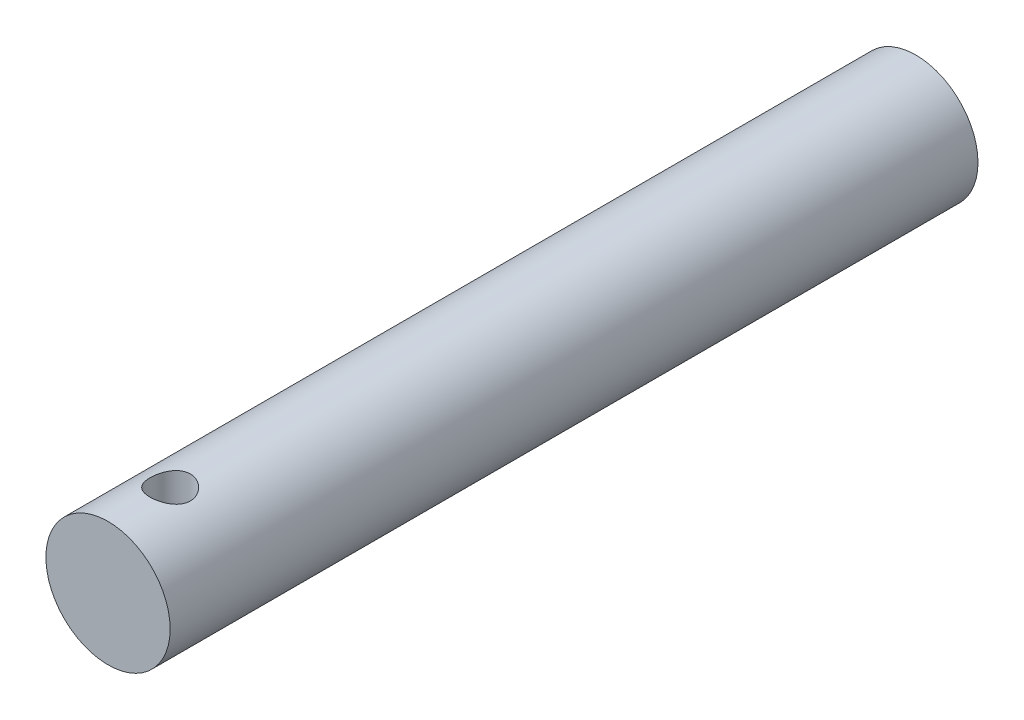
ISO-10303-21;
HEADER;
FILE_DESCRIPTION(('STEP AP214'),'2;1');
FILE_NAME('part.step','',(''),(''),'','','');
FILE_SCHEMA(('AUTOMOTIVE_DESIGN { 1 0 10303 214 1 1 1 1 }'));
ENDSEC;
DATA;
#1=APPLICATION_CONTEXT('core data for automotive mechanical design processes');
#2=APPLICATION_PROTOCOL_DEFINITION('international standard','automotive_design',2000,#1);
#3=PRODUCT_CONTEXT('',#1,'mechanical');
#4=PRODUCT('Part','Part','',(#3));
#5=PRODUCT_RELATED_PRODUCT_CATEGORY('part','',(#4));
#6=PRODUCT_DEFINITION_FORMATION('','',#4);
#7=PRODUCT_DEFINITION_CONTEXT('part definition',#1,'design');
#8=PRODUCT_DEFINITION('design','',#6,#7);
#9=PRODUCT_DEFINITION_SHAPE('','',#8);
#10=(LENGTH_UNIT() NAMED_UNIT(*) SI_UNIT(.MILLI.,.METRE.));
#11=(NAMED_UNIT(*) PLANE_ANGLE_UNIT() SI_UNIT($,.RADIAN.));
#12=(NAMED_UNIT(*) SI_UNIT($,.STERADIAN.) SOLID_ANGLE_UNIT());
#13=UNCERTAINTY_MEASURE_WITH_UNIT(LENGTH_MEASURE(1.E-05),#10,'distance_accuracy_value','');
#14=(GEOMETRIC_REPRESENTATION_CONTEXT(3) GLOBAL_UNCERTAINTY_ASSIGNED_CONTEXT((#13)) GLOBAL_UNIT_ASSIGNED_CONTEXT((#10,
#11,#12)) REPRESENTATION_CONTEXT('',''));
#15=CARTESIAN_POINT('',(0.,0.,0.));
#16=DIRECTION('',(0.,0.,1.));
#17=DIRECTION('',(1.,0.,0.));
#18=AXIS2_PLACEMENT_3D('',#15,#16,#17);
#19=CARTESIAN_POINT('',(0.,5.6843418860808E-11,60.));
#20=DIRECTION('',(0.,1.,0.));
#21=DIRECTION('',(0.,0.,1.));
#22=AXIS2_PLACEMENT_3D('',#19,#20,#21);
#23=CONICAL_SURFACE('',#22,1.6210000000001,1.02974425864687);
#24=CARTESIAN_POINT('',(0.,0.,60.));
#25=DIRECTION('',(0.,1.,0.));
#26=DIRECTION('',(0.,0.,1.));
#27=AXIS2_PLACEMENT_3D('',#24,#25,#26);
#28=CIRCLE('',#27,1.621);
#29=CARTESIAN_POINT('',(0.,0.,61.621));
#30=VERTEX_POINT('',#29);
#31=EDGE_CURVE('E58',#30,#30,#28,.T.);
#32=ORIENTED_EDGE('',*,*,#31,.T.);
#33=EDGE_LOOP('',(#32));
#34=FACE_BOUND('',#33,.T.);
#35=CARTESIAN_POINT('',(5.6843418860808E-11,-0.973995063418442,60.));
#36=VERTEX_POINT('',#35);
#37=VERTEX_LOOP('',#36);
#38=FACE_BOUND('',#37,.T.);
#39=ADVANCED_FACE('F19',(#34,#38),#23,.F.);
#40=CARTESIAN_POINT('',(0.,0.,65.));
#41=DIRECTION('',(0.,0.,1.));
#42=DIRECTION('',(1.,0.,0.));
#43=AXIS2_PLACEMENT_3D('',#40,#41,#42);
#44=PLANE('',#43);
#45=CARTESIAN_POINT('',(0.,0.,65.));
#46=DIRECTION('',(0.,0.,1.));
#47=DIRECTION('',(1.,0.,0.));
#48=AXIS2_PLACEMENT_3D('',#45,#46,#47);
#49=CIRCLE('',#48,5.);
#50=CARTESIAN_POINT('',(5.,0.,65.));
#51=VERTEX_POINT('',#50);
#52=EDGE_CURVE('E22',#51,#51,#49,.F.);
#53=ORIENTED_EDGE('',*,*,#52,.F.);
#54=EDGE_LOOP('',(#53));
#55=FACE_BOUND('',#54,.T.);
#56=ADVANCED_FACE('F31',(#55),#44,.T.);
#57=CARTESIAN_POINT('',(0.,0.,0.));
#58=DIRECTION('',(0.,0.,1.));
#59=DIRECTION('',(1.,0.,0.));
#60=AXIS2_PLACEMENT_3D('',#57,#58,#59);
#61=PLANE('',#60);
#62=CARTESIAN_POINT('',(0.,0.,0.));
#63=DIRECTION('',(0.,0.,1.));
#64=DIRECTION('',(1.,0.,0.));
#65=AXIS2_PLACEMENT_3D('',#62,#63,#64);
#66=CIRCLE('',#65,5.);
#67=CARTESIAN_POINT('',(5.,0.,0.));
#68=VERTEX_POINT('',#67);
#69=EDGE_CURVE('E26',#68,#68,#66,.T.);
#70=ORIENTED_EDGE('',*,*,#69,.F.);
#71=EDGE_LOOP('',(#70));
#72=FACE_BOUND('',#71,.T.);
#73=ADVANCED_FACE('F37',(#72),#61,.F.);
#74=CARTESIAN_POINT('',(0.,2.5,60.));
#75=DIRECTION('',(0.,1.,0.));
#76=DIRECTION('',(0.,0.,1.));
#77=AXIS2_PLACEMENT_3D('',#74,#75,#76);
#78=CYLINDRICAL_SURFACE('',#77,1.621);
#79=ORIENTED_EDGE('',*,*,#31,.F.);
#80=EDGE_LOOP('',(#79));
#81=FACE_BOUND('',#80,.T.);
#82=CARTESIAN_POINT('',(0.,5.,58.379));
#83=CARTESIAN_POINT('',(0.0884619620832092,4.99999655324265,58.3790049290715));
#84=CARTESIAN_POINT('',(0.17701662604503,4.99762679602547,58.3862749697745));
#85=CARTESIAN_POINT('',(0.351616438438128,4.98839078759883,58.4151142142982));
#86=CARTESIAN_POINT('',(0.437657085052407,4.98151693159598,58.4367076026522));
#87=CARTESIAN_POINT('',(0.604550554239639,4.96402494744011,58.4933791599554));
#88=CARTESIAN_POINT('',(0.685414412106266,4.95341512019038,58.5284274490969));
#89=CARTESIAN_POINT('',(0.840085715910895,4.92954240053135,58.6109059576044));
#90=CARTESIAN_POINT('',(0.913894288240304,4.91627993267083,58.6583341959592));
#91=CARTESIAN_POINT('',(1.05483387779506,4.88801066400949,58.7658785158848));
#92=CARTESIAN_POINT('',(1.12170060831867,4.8729636811772,58.8263303549155));
#93=CARTESIAN_POINT('',(1.24456130927857,4.84304396322505,58.9575088794059));
#94=CARTESIAN_POINT('',(1.30055057954461,4.82817130602834,59.0282399835813));
#95=CARTESIAN_POINT('',(1.40153831262747,4.79984603805234,59.1803120945652));
#96=CARTESIAN_POINT('',(1.44619490086784,4.78644329444185,59.2618900832604));
#97=CARTESIAN_POINT('',(1.52100265561001,4.76320270011437,59.4318546940439));
#98=CARTESIAN_POINT('',(1.55117173151528,4.75336045166184,59.5202327522082));
#99=CARTESIAN_POINT('',(1.58926692682533,4.74072730397179,59.6741790291682));
#100=CARTESIAN_POINT('',(1.60114236846288,4.7367091181779,59.738695863912));
#101=CARTESIAN_POINT('',(1.61701000451412,4.73131577154345,59.8688002450988));
#102=CARTESIAN_POINT('',(1.62100285514092,4.72994039069385,59.9343877019559));
#103=CARTESIAN_POINT('',(1.62099615377012,4.72994607261191,60.0883879249356));
#104=CARTESIAN_POINT('',(1.6137411243198,4.73244969105923,60.1768209302674));
#105=CARTESIAN_POINT('',(1.58498436651365,4.74215611685262,60.3511177575609));
#106=CARTESIAN_POINT('',(1.56346953292972,4.74936324678656,60.4369791401787));
#107=CARTESIAN_POINT('',(1.50702334763213,4.76757289380325,60.6035195405774));
#108=CARTESIAN_POINT('',(1.47212086259878,4.77856723966283,60.6842092756527));
#109=CARTESIAN_POINT('',(1.38998006678925,4.8031016269512,60.838598089181));
#110=CARTESIAN_POINT('',(1.34274120430601,4.81664178222601,60.9122968547831));
#111=CARTESIAN_POINT('',(1.23539607827547,4.84530476348867,61.0533533344694));
#112=CARTESIAN_POINT('',(1.17491131081036,4.86046544549405,61.1204153800948));
#113=CARTESIAN_POINT('',(1.04358460444831,4.89034353990335,61.2436573503482));
#114=CARTESIAN_POINT('',(0.972739120795818,4.90506079851022,61.2998335351951));
#115=CARTESIAN_POINT('',(0.820544497364452,4.93283212686759,61.4010372311341));
#116=CARTESIAN_POINT('',(0.738977665484764,4.94583563226711,61.4457521585395));
#117=CARTESIAN_POINT('',(0.569034715373961,4.96825049262192,61.5206712189359));
#118=CARTESIAN_POINT('',(0.48066681710538,4.9776661045364,61.5508925593412));
#119=CARTESIAN_POINT('',(0.326587100409989,4.9897330810008,61.5891167418802));
#120=CARTESIAN_POINT('',(0.261915284807039,4.99356185523025,61.6010489345835));
#121=CARTESIAN_POINT('',(0.131503843570188,4.9986962173826,61.6169916788246));
#122=CARTESIAN_POINT('',(0.0657642921054396,5.00000197981436,61.6210027782402));
#123=CARTESIAN_POINT('',(-0.0885255665617281,4.99999733496427,61.6209962602001));
#124=CARTESIAN_POINT('',(-0.177095963054675,4.99762504677786,61.6137193918878));
#125=CARTESIAN_POINT('',(-0.351678811386076,4.98838503099492,61.5848679931243));
#126=CARTESIAN_POINT('',(-0.437688935948333,4.9815133365135,61.56328084586));
#127=CARTESIAN_POINT('',(-0.604544046091126,4.96402588587819,61.5066237845629));
#128=CARTESIAN_POINT('',(-0.685398560929311,4.95341728850284,61.4715796385908));
#129=CARTESIAN_POINT('',(-0.840070234241533,4.92954506879379,61.3891036635857));
#130=CARTESIAN_POINT('',(-0.913887097216427,4.9162813350478,61.3416713147052));
#131=CARTESIAN_POINT('',(-1.05484147543932,4.88800918126431,61.2341156624772));
#132=CARTESIAN_POINT('',(-1.12171461255367,4.87296056714949,61.1736564853218));
#133=CARTESIAN_POINT('',(-1.24457285493752,4.84304085448938,61.0424769994452));
#134=CARTESIAN_POINT('',(-1.30055551999293,4.82816979642788,60.9717543971955));
#135=CARTESIAN_POINT('',(-1.4015141831025,4.79985293318417,60.8197223714669));
#136=CARTESIAN_POINT('',(-1.44615325040447,4.78645628241094,60.7381791727829));
#137=CARTESIAN_POINT('',(-1.52097277442631,4.76321194001015,60.5682385078864));
#138=CARTESIAN_POINT('',(-1.55115738723404,4.75336322844597,60.4798430204155));
#139=CARTESIAN_POINT('',(-1.59523216463718,4.73875102529737,60.3016976482162));
#140=CARTESIAN_POINT('',(-1.60961461170562,4.73383434301149,60.2120824864396));
#141=CARTESIAN_POINT('',(-1.62321533051244,4.72918898792716,60.0315864849456));
#142=CARTESIAN_POINT('',(-1.62243798201116,4.72945881671268,59.9407060183647));
#143=CARTESIAN_POINT('',(-1.60612465231871,4.73502131472166,59.7644008630548));
#144=CARTESIAN_POINT('',(-1.59122361954965,4.74009788073007,59.6789094376623));
#145=CARTESIAN_POINT('',(-1.54811876888699,4.75434941139952,59.5117121781835));
#146=CARTESIAN_POINT('',(-1.51991337924232,4.76352486028789,59.4300067926255));
#147=CARTESIAN_POINT('',(-1.45056956414407,4.78509970892701,59.2712257445096));
#148=CARTESIAN_POINT('',(-1.4092377147209,4.7975468117096,59.1942413169552));
#149=CARTESIAN_POINT('',(-1.31495086028515,4.8242407877091,59.0481009775889));
#150=CARTESIAN_POINT('',(-1.26199328378351,4.838488058808,58.9789468028847));
#151=CARTESIAN_POINT('',(-1.14288834630329,4.86803306245596,58.846857636417));
#152=CARTESIAN_POINT('',(-1.07622137649476,4.88334803995836,58.784394172462));
#153=CARTESIAN_POINT('',(-0.933141712601135,4.91269503727051,58.6713920048066));
#154=CARTESIAN_POINT('',(-0.856724798699757,4.9267264970268,58.620858491592));
#155=CARTESIAN_POINT('',(-0.695332802887699,4.95209518208183,58.5327961291046));
#156=CARTESIAN_POINT('',(-0.610282317735249,4.96340512939235,58.4953973485373));
#157=CARTESIAN_POINT('',(-0.434737128435639,4.98184170165487,58.4356454230423));
#158=CARTESIAN_POINT('',(-0.344254014980918,4.98897690673623,58.4132614050835));
#159=CARTESIAN_POINT('',(-0.210785285288128,4.99573136308711,58.3922056456857));
#160=CARTESIAN_POINT('',(-0.168803789799709,4.99732740016946,58.3872595229472));
#161=CARTESIAN_POINT('',(-0.0845552582841879,4.99946254424872,58.380655516419));
#162=CARTESIAN_POINT('',(-0.0422882212949861,5.00000164768262,58.3789976437142));
#163=CARTESIAN_POINT('',(0.,5.,58.379));
#164=B_SPLINE_CURVE_WITH_KNOTS('',3,(#82,#83,#84,#85,#86,#87,#88,#89,#90,#91,#92,#93,#94,#95,
#96,#97,#98,#99,#100,#101,#102,#103,#104,#105,#106,#107,#108,#109,#110,#111,#112,#113,#114,#115,
#116,#117,#118,#119,#120,#121,#122,#123,#124,#125,#126,#127,#128,#129,#130,#131,#132,#133,#134,
#135,#136,#137,#138,#139,#140,#141,#142,#143,#144,#145,#146,#147,#148,#149,#150,#151,#152,#153,
#154,#155,#156,#157,#158,#159,#160,#161,#162,#163),.UNSPECIFIED.,.T.,.F.,(4,2,2,2,2,2,2,2,2,2,2,
2,2,2,2,2,2,2,2,2,2,2,2,2,2,2,2,2,2,2,2,2,2,2,2,2,2,2,2,2,4),(0.,0.265222841873655,
0.530894648192888,0.795979848452876,1.06102265636092,1.33395777121528,1.6070105607925,
1.88751958253262,2.16768094175565,2.36435054694468,2.56100377901275,2.8259201381789,
3.09108030239694,3.35567190890172,3.62027535049054,3.89375554979629,4.16732953588904,
4.44771849409328,4.72777373318732,4.92489712311948,5.12200687815272,5.38733707757439,
5.65290151993619,5.91795996317593,6.18302953087616,6.4559929371093,6.72901743563104,
7.00939294927565,7.28968779809965,7.5609786763992,7.83219117821797,8.09176185035657,
8.35136319535684,8.61498272668893,8.87866062675682,9.15527392883305,9.43200735900437,
9.71140865159736,9.9902336696722,10.1170199646669,10.2438066870673),.UNSPECIFIED.);
#165=CARTESIAN_POINT('',(0.,5.,58.379));
#166=VERTEX_POINT('',#165);
#167=EDGE_CURVE('E11',#166,#166,#164,.T.);
#168=ORIENTED_EDGE('',*,*,#167,.F.);
#169=EDGE_LOOP('',(#168));
#170=FACE_BOUND('',#169,.T.);
#171=ADVANCED_FACE('F42',(#81,#170),#78,.F.);
#172=CARTESIAN_POINT('',(0.,0.,0.));
#173=DIRECTION('',(0.,0.,1.));
#174=DIRECTION('',(1.,0.,0.));
#175=AXIS2_PLACEMENT_3D('',#172,#173,#174);
#176=CYLINDRICAL_SURFACE('',#175,5.);
#177=ORIENTED_EDGE('',*,*,#69,.T.);
#178=EDGE_LOOP('',(#177));
#179=FACE_BOUND('',#178,.T.);
#180=ORIENTED_EDGE('',*,*,#167,.T.);
#181=EDGE_LOOP('',(#180));
#182=FACE_BOUND('',#181,.T.);
#183=ORIENTED_EDGE('',*,*,#52,.T.);
#184=EDGE_LOOP('',(#183));
#185=FACE_BOUND('',#184,.T.);
#186=ADVANCED_FACE('F40',(#179,#182,#185),#176,.T.);
#187=CLOSED_SHELL('',(#39,#56,#73,#171,#186));
#188=MANIFOLD_SOLID_BREP('B1',#187);
#189=ADVANCED_BREP_SHAPE_REPRESENTATION('',(#18,#188),#14);
#190=SHAPE_DEFINITION_REPRESENTATION(#9,#189);
ENDSEC;
END-ISO-10303-21;
